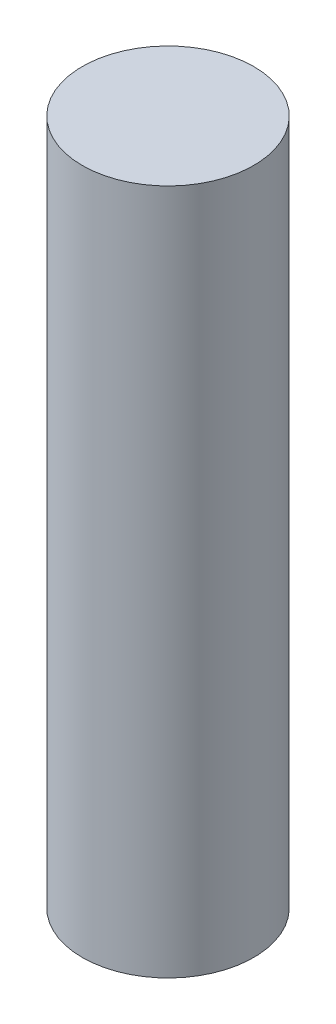
ISO-10303-21;
HEADER;
FILE_DESCRIPTION(('STEP AP214'),'2;1');
FILE_NAME('part.step','',(''),(''),'','','');
FILE_SCHEMA(('AUTOMOTIVE_DESIGN { 1 0 10303 214 1 1 1 1 }'));
ENDSEC;
DATA;
#1=APPLICATION_CONTEXT('core data for automotive mechanical design processes');
#2=APPLICATION_PROTOCOL_DEFINITION('international standard','automotive_design',2000,#1);
#3=PRODUCT_CONTEXT('',#1,'mechanical');
#4=PRODUCT('Part','Part','',(#3));
#5=PRODUCT_RELATED_PRODUCT_CATEGORY('part','',(#4));
#6=PRODUCT_DEFINITION_FORMATION('','',#4);
#7=PRODUCT_DEFINITION_CONTEXT('part definition',#1,'design');
#8=PRODUCT_DEFINITION('design','',#6,#7);
#9=PRODUCT_DEFINITION_SHAPE('','',#8);
#10=(LENGTH_UNIT() NAMED_UNIT(*) SI_UNIT(.MILLI.,.METRE.));
#11=(NAMED_UNIT(*) PLANE_ANGLE_UNIT() SI_UNIT($,.RADIAN.));
#12=(NAMED_UNIT(*) SI_UNIT($,.STERADIAN.) SOLID_ANGLE_UNIT());
#13=UNCERTAINTY_MEASURE_WITH_UNIT(LENGTH_MEASURE(1.E-05),#10,'distance_accuracy_value','');
#14=(GEOMETRIC_REPRESENTATION_CONTEXT(3) GLOBAL_UNCERTAINTY_ASSIGNED_CONTEXT((#13)) GLOBAL_UNIT_ASSIGNED_CONTEXT((#10,
#11,#12)) REPRESENTATION_CONTEXT('',''));
#15=CARTESIAN_POINT('',(0.,0.,0.));
#16=DIRECTION('',(0.,0.,1.));
#17=DIRECTION('',(1.,0.,0.));
#18=AXIS2_PLACEMENT_3D('',#15,#16,#17);
#19=CARTESIAN_POINT('',(0.,16.,0.));
#20=DIRECTION('',(0.,-1.,0.));
#21=DIRECTION('',(0.,0.,-1.));
#22=AXIS2_PLACEMENT_3D('',#19,#20,#21);
#23=CYLINDRICAL_SURFACE('',#22,2.);
#24=CARTESIAN_POINT('',(0.,16.,0.));
#25=DIRECTION('',(0.,1.,0.));
#26=DIRECTION('',(0.,0.,1.));
#27=AXIS2_PLACEMENT_3D('',#24,#25,#26);
#28=CIRCLE('',#27,2.);
#29=CARTESIAN_POINT('',(0.,16.,2.));
#30=VERTEX_POINT('',#29);
#31=EDGE_CURVE('E10',#30,#30,#28,.T.);
#32=ORIENTED_EDGE('',*,*,#31,.F.);
#33=EDGE_LOOP('',(#32));
#34=FACE_BOUND('',#33,.T.);
#35=CARTESIAN_POINT('',(0.,0.,0.));
#36=DIRECTION('',(0.,1.,0.));
#37=DIRECTION('',(0.,0.,1.));
#38=AXIS2_PLACEMENT_3D('',#35,#36,#37);
#39=CIRCLE('',#38,2.);
#40=CARTESIAN_POINT('',(0.,0.,2.));
#41=VERTEX_POINT('',#40);
#42=EDGE_CURVE('E32',#41,#41,#39,.T.);
#43=ORIENTED_EDGE('',*,*,#42,.T.);
#44=EDGE_LOOP('',(#43));
#45=FACE_BOUND('',#44,.T.);
#46=ADVANCED_FACE('F29',(#34,#45),#23,.T.);
#47=CARTESIAN_POINT('',(0.,16.,0.));
#48=DIRECTION('',(0.,1.,0.));
#49=DIRECTION('',(0.,0.,1.));
#50=AXIS2_PLACEMENT_3D('',#47,#48,#49);
#51=PLANE('',#50);
#52=ORIENTED_EDGE('',*,*,#31,.T.);
#53=EDGE_LOOP('',(#52));
#54=FACE_BOUND('',#53,.T.);
#55=ADVANCED_FACE('F44',(#54),#51,.T.);
#56=CARTESIAN_POINT('',(0.,0.,0.));
#57=DIRECTION('',(0.,1.,0.));
#58=DIRECTION('',(0.,0.,1.));
#59=AXIS2_PLACEMENT_3D('',#56,#57,#58);
#60=PLANE('',#59);
#61=ORIENTED_EDGE('',*,*,#42,.F.);
#62=EDGE_LOOP('',(#61));
#63=FACE_BOUND('',#62,.T.);
#64=ADVANCED_FACE('F42',(#63),#60,.F.);
#65=CLOSED_SHELL('',(#46,#55,#64));
#66=MANIFOLD_SOLID_BREP('B2',#65);
#67=ADVANCED_BREP_SHAPE_REPRESENTATION('',(#18,#66),#14);
#68=SHAPE_DEFINITION_REPRESENTATION(#9,#67);
ENDSEC;
END-ISO-10303-21;
